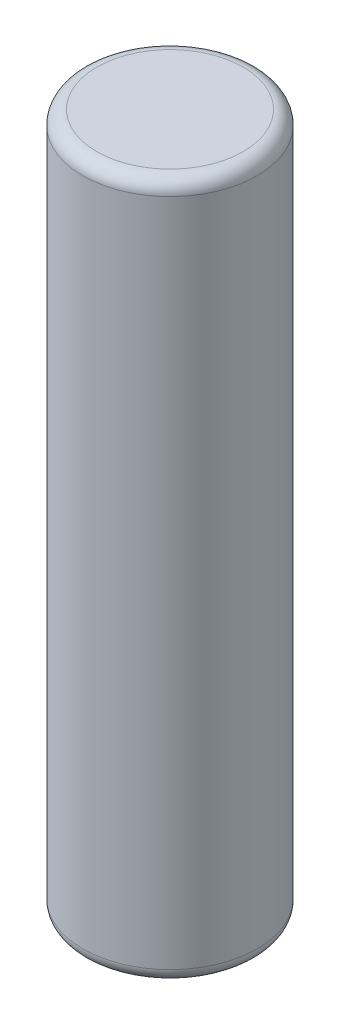
ISO-10303-21;
HEADER;
FILE_DESCRIPTION(('STEP AP214'),'2;1');
FILE_NAME('part.step','',(''),(''),'','','');
FILE_SCHEMA(('AUTOMOTIVE_DESIGN { 1 0 10303 214 1 1 1 1 }'));
ENDSEC;
DATA;
#1=APPLICATION_CONTEXT('core data for automotive mechanical design processes');
#2=APPLICATION_PROTOCOL_DEFINITION('international standard','automotive_design',2000,#1);
#3=PRODUCT_CONTEXT('',#1,'mechanical');
#4=PRODUCT('Part','Part','',(#3));
#5=PRODUCT_RELATED_PRODUCT_CATEGORY('part','',(#4));
#6=PRODUCT_DEFINITION_FORMATION('','',#4);
#7=PRODUCT_DEFINITION_CONTEXT('part definition',#1,'design');
#8=PRODUCT_DEFINITION('design','',#6,#7);
#9=PRODUCT_DEFINITION_SHAPE('','',#8);
#10=(LENGTH_UNIT() NAMED_UNIT(*) SI_UNIT(.MILLI.,.METRE.));
#11=(NAMED_UNIT(*) PLANE_ANGLE_UNIT() SI_UNIT($,.RADIAN.));
#12=(NAMED_UNIT(*) SI_UNIT($,.STERADIAN.) SOLID_ANGLE_UNIT());
#13=UNCERTAINTY_MEASURE_WITH_UNIT(LENGTH_MEASURE(1.E-05),#10,'distance_accuracy_value','');
#14=(GEOMETRIC_REPRESENTATION_CONTEXT(3) GLOBAL_UNCERTAINTY_ASSIGNED_CONTEXT((#13)) GLOBAL_UNIT_ASSIGNED_CONTEXT((#10,
#11,#12)) REPRESENTATION_CONTEXT('',''));
#15=CARTESIAN_POINT('',(0.,0.,0.));
#16=DIRECTION('',(0.,0.,1.));
#17=DIRECTION('',(1.,0.,0.));
#18=AXIS2_PLACEMENT_3D('',#15,#16,#17);
#19=CARTESIAN_POINT('',(2.667,25.4,0.));
#20=DIRECTION('',(0.,1.,0.));
#21=DIRECTION('',(0.,0.,1.));
#22=AXIS2_PLACEMENT_3D('',#19,#20,#21);
#23=PLANE('',#22);
#24=CARTESIAN_POINT('',(0.,25.4,0.));
#25=DIRECTION('',(0.,-1.,0.));
#26=DIRECTION('',(0.,0.,-1.));
#27=AXIS2_PLACEMENT_3D('',#24,#25,#26);
#28=CIRCLE('',#27,2.667);
#29=CARTESIAN_POINT('',(0.,25.4,-2.667));
#30=VERTEX_POINT('',#29);
#31=CARTESIAN_POINT('',(0.,25.4,2.667));
#32=VERTEX_POINT('',#31);
#33=EDGE_CURVE('E46',#30,#32,#28,.T.);
#34=ORIENTED_EDGE('',*,*,#33,.F.);
#35=CARTESIAN_POINT('',(0.,25.4,0.));
#36=DIRECTION('',(0.,-1.,0.));
#37=DIRECTION('',(0.,0.,1.));
#38=AXIS2_PLACEMENT_3D('',#35,#36,#37);
#39=CIRCLE('',#38,2.667);
#40=EDGE_CURVE('E49',#32,#30,#39,.T.);
#41=ORIENTED_EDGE('',*,*,#40,.F.);
#42=EDGE_LOOP('',(#34,#41));
#43=FACE_BOUND('',#42,.T.);
#44=ADVANCED_FACE('F17',(#43),#23,.T.);
#45=CARTESIAN_POINT('',(0.,0.,0.));
#46=DIRECTION('',(0.,-1.,0.));
#47=DIRECTION('',(0.,0.,-1.));
#48=AXIS2_PLACEMENT_3D('',#45,#46,#47);
#49=PLANE('',#48);
#50=CARTESIAN_POINT('',(0.,0.,0.));
#51=DIRECTION('',(0.,1.,0.));
#52=DIRECTION('',(0.,0.,1.));
#53=AXIS2_PLACEMENT_3D('',#50,#51,#52);
#54=CIRCLE('',#53,2.667);
#55=CARTESIAN_POINT('',(0.,0.,2.667));
#56=VERTEX_POINT('',#55);
#57=CARTESIAN_POINT('',(0.,0.,-2.667));
#58=VERTEX_POINT('',#57);
#59=EDGE_CURVE('E56',#56,#58,#54,.T.);
#60=ORIENTED_EDGE('',*,*,#59,.F.);
#61=CARTESIAN_POINT('',(0.,0.,0.));
#62=DIRECTION('',(0.,1.,0.));
#63=DIRECTION('',(0.,0.,-1.));
#64=AXIS2_PLACEMENT_3D('',#61,#62,#63);
#65=CIRCLE('',#64,2.667);
#66=EDGE_CURVE('E37',#58,#56,#65,.T.);
#67=ORIENTED_EDGE('',*,*,#66,.F.);
#68=EDGE_LOOP('',(#60,#67));
#69=FACE_BOUND('',#68,.T.);
#70=ADVANCED_FACE('F74',(#69),#49,.T.);
#71=CARTESIAN_POINT('',(0.,24.892,0.));
#72=DIRECTION('',(0.,-1.,0.));
#73=DIRECTION('',(0.,0.,-1.));
#74=AXIS2_PLACEMENT_3D('',#71,#72,#73);
#75=TOROIDAL_SURFACE('',#74,2.667,0.508000000000002);
#76=CARTESIAN_POINT('',(0.,24.892,0.));
#77=DIRECTION('',(0.,-1.,0.));
#78=DIRECTION('',(0.,0.,-1.));
#79=AXIS2_PLACEMENT_3D('',#76,#77,#78);
#80=CIRCLE('',#79,3.175);
#81=CARTESIAN_POINT('',(0.,24.892,-3.175));
#82=VERTEX_POINT('',#81);
#83=EDGE_CURVE('E29',#82,#82,#80,.T.);
#84=ORIENTED_EDGE('',*,*,#83,.F.);
#85=EDGE_LOOP('',(#84));
#86=FACE_BOUND('',#85,.T.);
#87=ORIENTED_EDGE('',*,*,#33,.T.);
#88=ORIENTED_EDGE('',*,*,#40,.T.);
#89=EDGE_LOOP('',(#87,#88));
#90=FACE_BOUND('',#89,.T.);
#91=ADVANCED_FACE('F55',(#86,#90),#75,.T.);
#92=CARTESIAN_POINT('',(0.,0.508,0.));
#93=DIRECTION('',(0.,-1.,0.));
#94=DIRECTION('',(0.,0.,-1.));
#95=AXIS2_PLACEMENT_3D('',#92,#93,#94);
#96=TOROIDAL_SURFACE('',#95,2.667,0.508);
#97=ORIENTED_EDGE('',*,*,#66,.T.);
#98=ORIENTED_EDGE('',*,*,#59,.T.);
#99=EDGE_LOOP('',(#97,#98));
#100=FACE_BOUND('',#99,.T.);
#101=CARTESIAN_POINT('',(0.,0.508000000000002,0.));
#102=DIRECTION('',(0.,-1.,0.));
#103=DIRECTION('',(0.,0.,-1.));
#104=AXIS2_PLACEMENT_3D('',#101,#102,#103);
#105=CIRCLE('',#104,3.175);
#106=CARTESIAN_POINT('',(0.,0.508000000000002,-3.175));
#107=VERTEX_POINT('',#106);
#108=EDGE_CURVE('E11',#107,#107,#105,.F.);
#109=ORIENTED_EDGE('',*,*,#108,.F.);
#110=EDGE_LOOP('',(#109));
#111=FACE_BOUND('',#110,.T.);
#112=ADVANCED_FACE('F73',(#100,#111),#96,.T.);
#113=CARTESIAN_POINT('',(0.,25.4,0.));
#114=DIRECTION('',(0.,-1.,0.));
#115=DIRECTION('',(0.,0.,-1.));
#116=AXIS2_PLACEMENT_3D('',#113,#114,#115);
#117=CYLINDRICAL_SURFACE('',#116,3.175);
#118=ORIENTED_EDGE('',*,*,#108,.T.);
#119=EDGE_LOOP('',(#118));
#120=FACE_BOUND('',#119,.T.);
#121=ORIENTED_EDGE('',*,*,#83,.T.);
#122=EDGE_LOOP('',(#121));
#123=FACE_BOUND('',#122,.T.);
#124=ADVANCED_FACE('F122',(#120,#123),#117,.T.);
#125=CLOSED_SHELL('',(#44,#70,#91,#112,#124));
#126=MANIFOLD_SOLID_BREP('B1',#125);
#127=ADVANCED_BREP_SHAPE_REPRESENTATION('',(#18,#126),#14);
#128=SHAPE_DEFINITION_REPRESENTATION(#9,#127);
ENDSEC;
END-ISO-10303-21;
